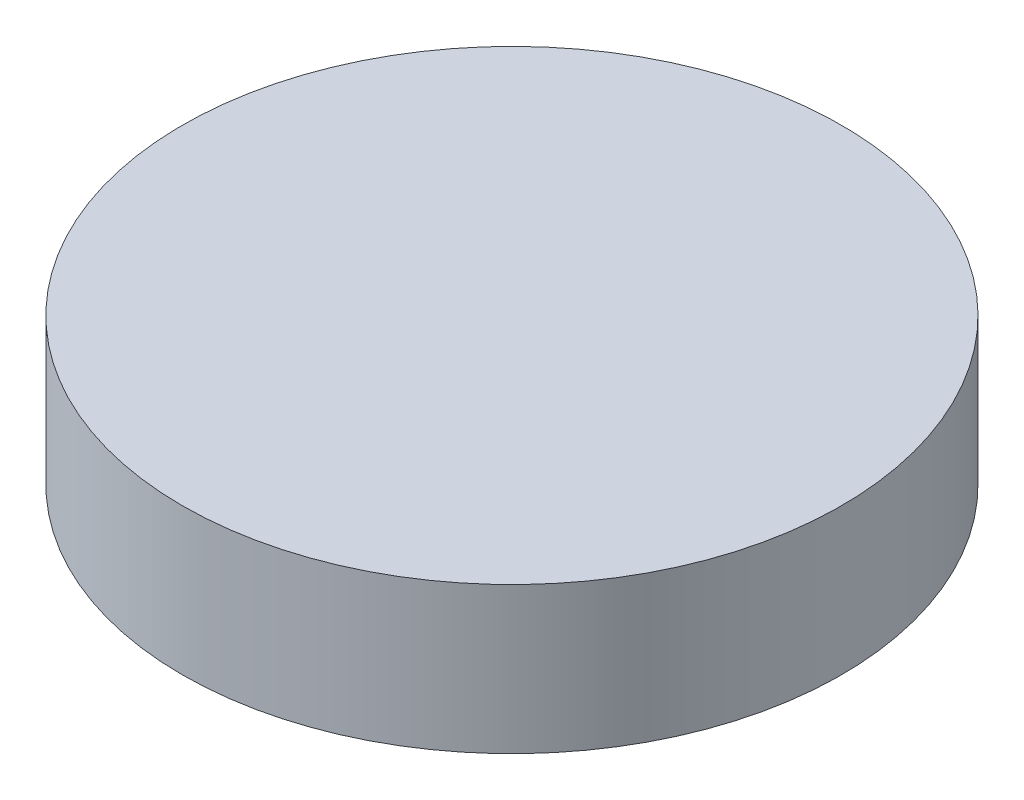
ISO-10303-21;
HEADER;
FILE_DESCRIPTION(('STEP AP214'),'2;1');
FILE_NAME('part.step','',(''),(''),'','','');
FILE_SCHEMA(('AUTOMOTIVE_DESIGN { 1 0 10303 214 1 1 1 1 }'));
ENDSEC;
DATA;
#1=APPLICATION_CONTEXT('core data for automotive mechanical design processes');
#2=APPLICATION_PROTOCOL_DEFINITION('international standard','automotive_design',2000,#1);
#3=PRODUCT_CONTEXT('',#1,'mechanical');
#4=PRODUCT('Part','Part','',(#3));
#5=PRODUCT_RELATED_PRODUCT_CATEGORY('part','',(#4));
#6=PRODUCT_DEFINITION_FORMATION('','',#4);
#7=PRODUCT_DEFINITION_CONTEXT('part definition',#1,'design');
#8=PRODUCT_DEFINITION('design','',#6,#7);
#9=PRODUCT_DEFINITION_SHAPE('','',#8);
#10=(LENGTH_UNIT() NAMED_UNIT(*) SI_UNIT(.MILLI.,.METRE.));
#11=(NAMED_UNIT(*) PLANE_ANGLE_UNIT() SI_UNIT($,.RADIAN.));
#12=(NAMED_UNIT(*) SI_UNIT($,.STERADIAN.) SOLID_ANGLE_UNIT());
#13=UNCERTAINTY_MEASURE_WITH_UNIT(LENGTH_MEASURE(1.E-05),#10,'distance_accuracy_value','');
#14=(GEOMETRIC_REPRESENTATION_CONTEXT(3) GLOBAL_UNCERTAINTY_ASSIGNED_CONTEXT((#13)) GLOBAL_UNIT_ASSIGNED_CONTEXT((#10,
#11,#12)) REPRESENTATION_CONTEXT('',''));
#15=CARTESIAN_POINT('',(0.,0.,0.));
#16=DIRECTION('',(0.,0.,1.));
#17=DIRECTION('',(1.,0.,0.));
#18=AXIS2_PLACEMENT_3D('',#15,#16,#17);
#19=CARTESIAN_POINT('',(0.,20.,0.));
#20=DIRECTION('',(0.,-1.,0.));
#21=DIRECTION('',(0.,0.,-1.));
#22=AXIS2_PLACEMENT_3D('',#19,#20,#21);
#23=CYLINDRICAL_SURFACE('',#22,45.);
#24=CARTESIAN_POINT('',(0.,20.,0.));
#25=DIRECTION('',(0.,1.,0.));
#26=DIRECTION('',(0.,0.,1.));
#27=AXIS2_PLACEMENT_3D('',#24,#25,#26);
#28=CIRCLE('',#27,45.);
#29=CARTESIAN_POINT('',(0.,20.,45.));
#30=VERTEX_POINT('',#29);
#31=EDGE_CURVE('E10',#30,#30,#28,.T.);
#32=ORIENTED_EDGE('',*,*,#31,.F.);
#33=EDGE_LOOP('',(#32));
#34=FACE_BOUND('',#33,.T.);
#35=CARTESIAN_POINT('',(0.,0.,0.));
#36=DIRECTION('',(0.,1.,0.));
#37=DIRECTION('',(0.,0.,1.));
#38=AXIS2_PLACEMENT_3D('',#35,#36,#37);
#39=CIRCLE('',#38,45.);
#40=CARTESIAN_POINT('',(0.,0.,45.));
#41=VERTEX_POINT('',#40);
#42=EDGE_CURVE('E34',#41,#41,#39,.T.);
#43=ORIENTED_EDGE('',*,*,#42,.T.);
#44=EDGE_LOOP('',(#43));
#45=FACE_BOUND('',#44,.T.);
#46=ADVANCED_FACE('F31',(#34,#45),#23,.T.);
#47=CARTESIAN_POINT('',(0.,20.,0.));
#48=DIRECTION('',(0.,1.,0.));
#49=DIRECTION('',(0.,0.,1.));
#50=AXIS2_PLACEMENT_3D('',#47,#48,#49);
#51=PLANE('',#50);
#52=ORIENTED_EDGE('',*,*,#31,.T.);
#53=EDGE_LOOP('',(#52));
#54=FACE_BOUND('',#53,.T.);
#55=ADVANCED_FACE('F46',(#54),#51,.T.);
#56=CARTESIAN_POINT('',(0.,0.,0.));
#57=DIRECTION('',(0.,1.,0.));
#58=DIRECTION('',(0.,0.,1.));
#59=AXIS2_PLACEMENT_3D('',#56,#57,#58);
#60=PLANE('',#59);
#61=ORIENTED_EDGE('',*,*,#42,.F.);
#62=EDGE_LOOP('',(#61));
#63=FACE_BOUND('',#62,.T.);
#64=ADVANCED_FACE('F44',(#63),#60,.F.);
#65=CLOSED_SHELL('',(#46,#55,#64));
#66=MANIFOLD_SOLID_BREP('B2',#65);
#67=ADVANCED_BREP_SHAPE_REPRESENTATION('',(#18,#66),#14);
#68=SHAPE_DEFINITION_REPRESENTATION(#9,#67);
ENDSEC;
END-ISO-10303-21;
